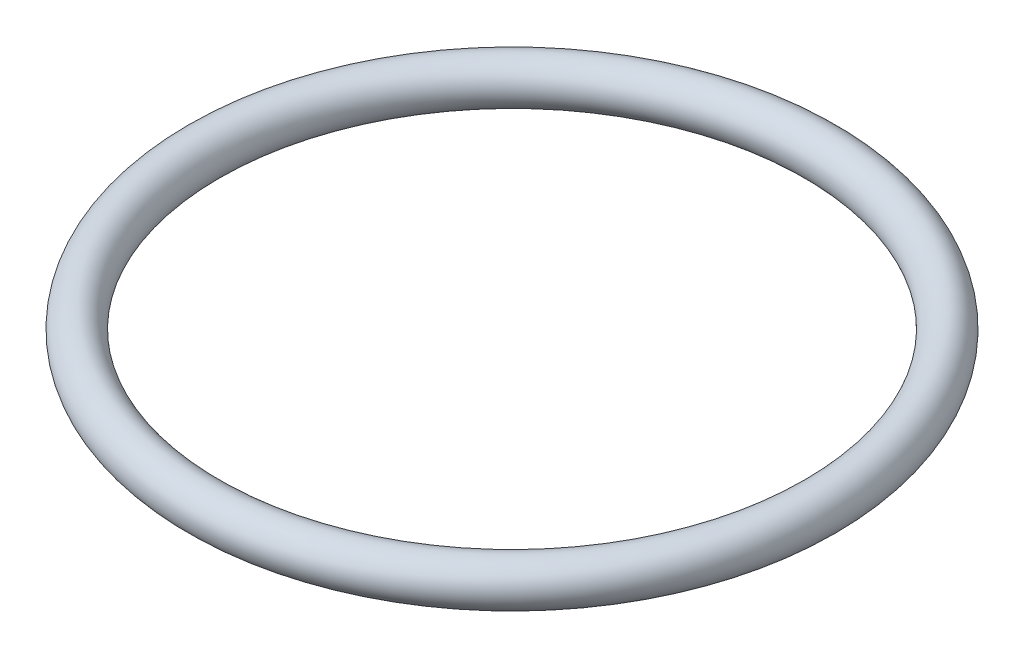
ISO-10303-21;
HEADER;
FILE_DESCRIPTION(('STEP AP214'),'2;1');
FILE_NAME('part.step','',(''),(''),'','','');
FILE_SCHEMA(('AUTOMOTIVE_DESIGN { 1 0 10303 214 1 1 1 1 }'));
ENDSEC;
DATA;
#1=APPLICATION_CONTEXT('core data for automotive mechanical design processes');
#2=APPLICATION_PROTOCOL_DEFINITION('international standard','automotive_design',2000,#1);
#3=PRODUCT_CONTEXT('',#1,'mechanical');
#4=PRODUCT('Part','Part','',(#3));
#5=PRODUCT_RELATED_PRODUCT_CATEGORY('part','',(#4));
#6=PRODUCT_DEFINITION_FORMATION('','',#4);
#7=PRODUCT_DEFINITION_CONTEXT('part definition',#1,'design');
#8=PRODUCT_DEFINITION('design','',#6,#7);
#9=PRODUCT_DEFINITION_SHAPE('','',#8);
#10=(LENGTH_UNIT() NAMED_UNIT(*) SI_UNIT(.MILLI.,.METRE.));
#11=(NAMED_UNIT(*) PLANE_ANGLE_UNIT() SI_UNIT($,.RADIAN.));
#12=(NAMED_UNIT(*) SI_UNIT($,.STERADIAN.) SOLID_ANGLE_UNIT());
#13=UNCERTAINTY_MEASURE_WITH_UNIT(LENGTH_MEASURE(1.E-05),#10,'distance_accuracy_value','');
#14=(GEOMETRIC_REPRESENTATION_CONTEXT(3) GLOBAL_UNCERTAINTY_ASSIGNED_CONTEXT((#13)) GLOBAL_UNIT_ASSIGNED_CONTEXT((#10,
#11,#12)) REPRESENTATION_CONTEXT('',''));
#15=CARTESIAN_POINT('',(0.,0.,0.));
#16=DIRECTION('',(0.,0.,1.));
#17=DIRECTION('',(1.,0.,0.));
#18=AXIS2_PLACEMENT_3D('',#15,#16,#17);
#19=CARTESIAN_POINT('',(0.,0.,0.));
#20=DIRECTION('',(0.,-1.,0.));
#21=DIRECTION('',(1.,0.,0.));
#22=AXIS2_PLACEMENT_3D('',#19,#20,#21);
#23=TOROIDAL_SURFACE('',#22,12.573,0.889);
#24=ADVANCED_FACE('F14',(),#23,.T.);
#25=CLOSED_SHELL('',(#24));
#26=MANIFOLD_SOLID_BREP('B1',#25);
#27=ADVANCED_BREP_SHAPE_REPRESENTATION('',(#18,#26),#14);
#28=SHAPE_DEFINITION_REPRESENTATION(#9,#27);
ENDSEC;
END-ISO-10303-21;
